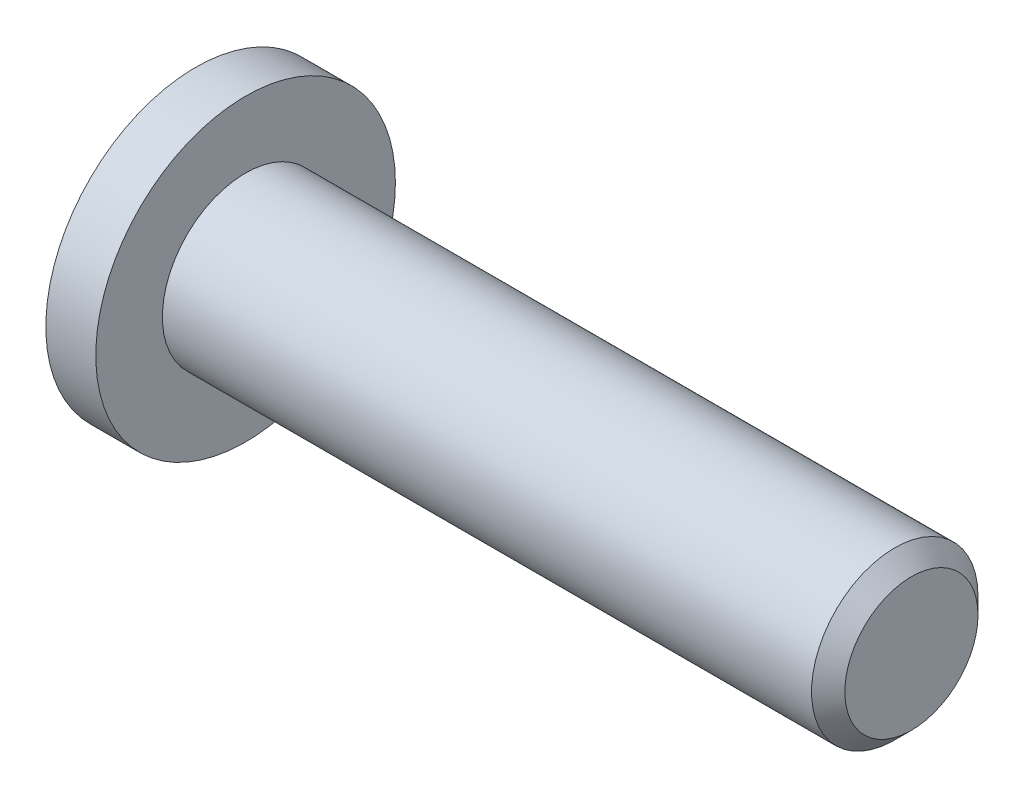
ISO-10303-21;
HEADER;
FILE_DESCRIPTION(('STEP AP214'),'2;1');
FILE_NAME('part.step','',(''),(''),'','','');
FILE_SCHEMA(('AUTOMOTIVE_DESIGN { 1 0 10303 214 1 1 1 1 }'));
ENDSEC;
DATA;
#1=APPLICATION_CONTEXT('core data for automotive mechanical design processes');
#2=APPLICATION_PROTOCOL_DEFINITION('international standard','automotive_design',2000,#1);
#3=PRODUCT_CONTEXT('',#1,'mechanical');
#4=PRODUCT('Part','Part','',(#3));
#5=PRODUCT_RELATED_PRODUCT_CATEGORY('part','',(#4));
#6=PRODUCT_DEFINITION_FORMATION('','',#4);
#7=PRODUCT_DEFINITION_CONTEXT('part definition',#1,'design');
#8=PRODUCT_DEFINITION('design','',#6,#7);
#9=PRODUCT_DEFINITION_SHAPE('','',#8);
#10=(LENGTH_UNIT() NAMED_UNIT(*) SI_UNIT(.MILLI.,.METRE.));
#11=(NAMED_UNIT(*) PLANE_ANGLE_UNIT() SI_UNIT($,.RADIAN.));
#12=(NAMED_UNIT(*) SI_UNIT($,.STERADIAN.) SOLID_ANGLE_UNIT());
#13=UNCERTAINTY_MEASURE_WITH_UNIT(LENGTH_MEASURE(1.E-05),#10,'distance_accuracy_value','');
#14=(GEOMETRIC_REPRESENTATION_CONTEXT(3) GLOBAL_UNCERTAINTY_ASSIGNED_CONTEXT((#13)) GLOBAL_UNIT_ASSIGNED_CONTEXT((#10,
#11,#12)) REPRESENTATION_CONTEXT('',''));
#15=CARTESIAN_POINT('',(0.,0.,0.));
#16=DIRECTION('',(0.,0.,1.));
#17=DIRECTION('',(1.,0.,0.));
#18=AXIS2_PLACEMENT_3D('',#15,#16,#17);
#19=CARTESIAN_POINT('',(1.5,0.,0.));
#20=DIRECTION('',(-1.,0.,0.));
#21=DIRECTION('',(0.,0.,1.));
#22=AXIS2_PLACEMENT_3D('',#19,#20,#21);
#23=CYLINDRICAL_SURFACE('',#22,4.5);
#24=CARTESIAN_POINT('',(1.5,0.,0.));
#25=DIRECTION('',(1.,0.,0.));
#26=DIRECTION('',(0.,0.,-1.));
#27=AXIS2_PLACEMENT_3D('',#24,#25,#26);
#28=CIRCLE('',#27,4.5);
#29=CARTESIAN_POINT('',(1.5,0.,-4.5));
#30=VERTEX_POINT('',#29);
#31=EDGE_CURVE('E149',#30,#30,#28,.T.);
#32=ORIENTED_EDGE('',*,*,#31,.F.);
#33=EDGE_LOOP('',(#32));
#34=FACE_BOUND('',#33,.T.);
#35=CARTESIAN_POINT('',(0.,0.,0.));
#36=DIRECTION('',(1.,0.,0.));
#37=DIRECTION('',(0.,0.,-1.));
#38=AXIS2_PLACEMENT_3D('',#35,#36,#37);
#39=CIRCLE('',#38,4.5);
#40=CARTESIAN_POINT('',(0.,0.,-4.5));
#41=VERTEX_POINT('',#40);
#42=EDGE_CURVE('E148',#41,#41,#39,.T.);
#43=ORIENTED_EDGE('',*,*,#42,.T.);
#44=EDGE_LOOP('',(#43));
#45=FACE_BOUND('',#44,.T.);
#46=ADVANCED_FACE('F38',(#34,#45),#23,.T.);
#47=CARTESIAN_POINT('',(1.5,0.,0.));
#48=DIRECTION('',(1.,0.,0.));
#49=DIRECTION('',(0.,0.,-1.));
#50=AXIS2_PLACEMENT_3D('',#47,#48,#49);
#51=PLANE('',#50);
#52=CARTESIAN_POINT('',(1.5,0.,0.));
#53=DIRECTION('',(1.,0.,0.));
#54=DIRECTION('',(0.,0.,-1.));
#55=AXIS2_PLACEMENT_3D('',#52,#53,#54);
#56=CIRCLE('',#55,2.5);
#57=CARTESIAN_POINT('',(1.5,0.,-2.5));
#58=VERTEX_POINT('',#57);
#59=EDGE_CURVE('E140',#58,#58,#56,.T.);
#60=ORIENTED_EDGE('',*,*,#59,.F.);
#61=EDGE_LOOP('',(#60));
#62=FACE_BOUND('',#61,.T.);
#63=ORIENTED_EDGE('',*,*,#31,.T.);
#64=EDGE_LOOP('',(#63));
#65=FACE_BOUND('',#64,.T.);
#66=ADVANCED_FACE('F167',(#62,#65),#51,.T.);
#67=CARTESIAN_POINT('',(0.,0.,0.));
#68=DIRECTION('',(1.,0.,0.));
#69=DIRECTION('',(0.,0.,-1.));
#70=AXIS2_PLACEMENT_3D('',#67,#68,#69);
#71=PLANE('',#70);
#72=DIRECTION('',(0.,-0.5,-0.866025403784439));
#73=VECTOR('',#72,1.);
#74=CARTESIAN_POINT('',(0.,1.7320508075689,0.));
#75=LINE('',#74,#73);
#76=CARTESIAN_POINT('',(0.,1.7320508075689,0.));
#77=VERTEX_POINT('',#76);
#78=CARTESIAN_POINT('',(0.,0.866025403784429,-1.50000000000002));
#79=VERTEX_POINT('',#78);
#80=EDGE_CURVE('E127',#77,#79,#75,.T.);
#81=ORIENTED_EDGE('',*,*,#80,.F.);
#82=DIRECTION('',(0.,0.499999999999998,-0.866025403784439));
#83=VECTOR('',#82,1.);
#84=CARTESIAN_POINT('',(0.,0.866025403784457,1.49999999999998));
#85=LINE('',#84,#83);
#86=CARTESIAN_POINT('',(0.,0.866025403784457,1.49999999999998));
#87=VERTEX_POINT('',#86);
#88=EDGE_CURVE('E53',#87,#77,#85,.T.);
#89=ORIENTED_EDGE('',*,*,#88,.F.);
#90=DIRECTION('',(0.,0.999999999999998,0.));
#91=VECTOR('',#90,1.);
#92=CARTESIAN_POINT('',(0.,-0.866025403784429,1.49999999999998));
#93=LINE('',#92,#91);
#94=CARTESIAN_POINT('',(0.,-0.866025403784429,1.49999999999998));
#95=VERTEX_POINT('',#94);
#96=EDGE_CURVE('E136',#95,#87,#93,.T.);
#97=ORIENTED_EDGE('',*,*,#96,.F.);
#98=DIRECTION('',(0.,0.5,0.866025403784439));
#99=VECTOR('',#98,1.);
#100=CARTESIAN_POINT('',(0.,-1.73205080756886,0.));
#101=LINE('',#100,#99);
#102=CARTESIAN_POINT('',(0.,-1.73205080756886,0.));
#103=VERTEX_POINT('',#102);
#104=EDGE_CURVE('E134',#103,#95,#101,.T.);
#105=ORIENTED_EDGE('',*,*,#104,.F.);
#106=DIRECTION('',(0.,-0.499999999999999,0.866025403784439));
#107=VECTOR('',#106,1.);
#108=CARTESIAN_POINT('',(0.,-0.866025403784415,-1.50000000000003));
#109=LINE('',#108,#107);
#110=CARTESIAN_POINT('',(0.,-0.866025403784415,-1.50000000000003));
#111=VERTEX_POINT('',#110);
#112=EDGE_CURVE('E101',#111,#103,#109,.T.);
#113=ORIENTED_EDGE('',*,*,#112,.F.);
#114=DIRECTION('',(0.,-0.999999999999998,0.));
#115=VECTOR('',#114,1.);
#116=CARTESIAN_POINT('',(0.,0.866025403784429,-1.50000000000002));
#117=LINE('',#116,#115);
#118=EDGE_CURVE('E130',#79,#111,#117,.T.);
#119=ORIENTED_EDGE('',*,*,#118,.F.);
#120=EDGE_LOOP('',(#81,#89,#97,#105,#113,#119));
#121=FACE_BOUND('',#120,.T.);
#122=ORIENTED_EDGE('',*,*,#42,.F.);
#123=EDGE_LOOP('',(#122));
#124=FACE_BOUND('',#123,.T.);
#125=ADVANCED_FACE('F172',(#121,#124),#71,.F.);
#126=CARTESIAN_POINT('',(21.5,0.,0.));
#127=DIRECTION('',(-1.,0.,0.));
#128=DIRECTION('',(0.,0.,1.));
#129=AXIS2_PLACEMENT_3D('',#126,#127,#128);
#130=CYLINDRICAL_SURFACE('',#129,2.5);
#131=CARTESIAN_POINT('',(21.,0.,0.));
#132=DIRECTION('',(1.,0.,0.));
#133=DIRECTION('',(0.,0.,-1.));
#134=AXIS2_PLACEMENT_3D('',#131,#132,#133);
#135=CIRCLE('',#134,2.5);
#136=CARTESIAN_POINT('',(21.,0.,-2.5));
#137=VERTEX_POINT('',#136);
#138=EDGE_CURVE('E11',#137,#137,#135,.F.);
#139=ORIENTED_EDGE('',*,*,#138,.T.);
#140=EDGE_LOOP('',(#139));
#141=FACE_BOUND('',#140,.T.);
#142=ORIENTED_EDGE('',*,*,#59,.T.);
#143=EDGE_LOOP('',(#142));
#144=FACE_BOUND('',#143,.T.);
#145=ADVANCED_FACE('F179',(#141,#144),#130,.T.);
#146=CARTESIAN_POINT('',(21.5,0.,0.));
#147=DIRECTION('',(1.,0.,0.));
#148=DIRECTION('',(0.,0.,-1.));
#149=AXIS2_PLACEMENT_3D('',#146,#147,#148);
#150=PLANE('',#149);
#151=CARTESIAN_POINT('',(21.5,0.,0.));
#152=DIRECTION('',(1.,0.,0.));
#153=DIRECTION('',(0.,0.,-1.));
#154=AXIS2_PLACEMENT_3D('',#151,#152,#153);
#155=CIRCLE('',#154,2.);
#156=CARTESIAN_POINT('',(21.5,0.,-2.));
#157=VERTEX_POINT('',#156);
#158=EDGE_CURVE('E46',#157,#157,#155,.T.);
#159=ORIENTED_EDGE('',*,*,#158,.T.);
#160=EDGE_LOOP('',(#159));
#161=FACE_BOUND('',#160,.T.);
#162=ADVANCED_FACE('F156',(#161),#150,.T.);
#163=CARTESIAN_POINT('',(3.,0.866025403784457,1.49999999999998));
#164=DIRECTION('',(0.,0.866025403784437,0.500000000000001));
#165=DIRECTION('',(0.,-0.499999999999998,0.866025403784439));
#166=AXIS2_PLACEMENT_3D('',#163,#164,#165);
#167=PLANE('',#166);
#168=ORIENTED_EDGE('',*,*,#88,.T.);
#169=DIRECTION('',(-1.,0.,0.));
#170=VECTOR('',#169,1.);
#171=CARTESIAN_POINT('',(3.,1.7320508075689,0.));
#172=LINE('',#171,#170);
#173=CARTESIAN_POINT('',(3.,1.7320508075689,0.));
#174=VERTEX_POINT('',#173);
#175=EDGE_CURVE('E83',#174,#77,#172,.T.);
#176=ORIENTED_EDGE('',*,*,#175,.F.);
#177=DIRECTION('',(0.,0.499999999999998,-0.866025403784439));
#178=VECTOR('',#177,1.);
#179=CARTESIAN_POINT('',(3.,0.866025403784457,1.49999999999998));
#180=LINE('',#179,#178);
#181=CARTESIAN_POINT('',(3.,0.866025403784457,1.49999999999998));
#182=VERTEX_POINT('',#181);
#183=EDGE_CURVE('E138',#182,#174,#180,.T.);
#184=ORIENTED_EDGE('',*,*,#183,.F.);
#185=DIRECTION('',(-1.,0.,0.));
#186=VECTOR('',#185,1.);
#187=CARTESIAN_POINT('',(3.,0.866025403784457,1.49999999999998));
#188=LINE('',#187,#186);
#189=EDGE_CURVE('E61',#182,#87,#188,.T.);
#190=ORIENTED_EDGE('',*,*,#189,.T.);
#191=EDGE_LOOP('',(#168,#176,#184,#190));
#192=FACE_BOUND('',#191,.T.);
#193=ADVANCED_FACE('F187',(#192),#167,.F.);
#194=CARTESIAN_POINT('',(3.,-0.866025403784429,1.49999999999998));
#195=DIRECTION('',(0.,0.,0.999999999999999));
#196=DIRECTION('',(0.,-0.999999999999998,0.));
#197=AXIS2_PLACEMENT_3D('',#194,#195,#196);
#198=PLANE('',#197);
#199=ORIENTED_EDGE('',*,*,#96,.T.);
#200=ORIENTED_EDGE('',*,*,#189,.F.);
#201=DIRECTION('',(0.,0.999999999999998,0.));
#202=VECTOR('',#201,1.);
#203=CARTESIAN_POINT('',(3.,-0.866025403784429,1.49999999999998));
#204=LINE('',#203,#202);
#205=CARTESIAN_POINT('',(3.,-0.866025403784429,1.49999999999998));
#206=VERTEX_POINT('',#205);
#207=EDGE_CURVE('E113',#206,#182,#204,.T.);
#208=ORIENTED_EDGE('',*,*,#207,.F.);
#209=DIRECTION('',(-1.,0.,0.));
#210=VECTOR('',#209,1.);
#211=CARTESIAN_POINT('',(3.,-0.866025403784429,1.49999999999998));
#212=LINE('',#211,#210);
#213=EDGE_CURVE('E105',#206,#95,#212,.T.);
#214=ORIENTED_EDGE('',*,*,#213,.T.);
#215=EDGE_LOOP('',(#199,#200,#208,#214));
#216=FACE_BOUND('',#215,.T.);
#217=ADVANCED_FACE('F190',(#216),#198,.F.);
#218=CARTESIAN_POINT('',(3.,-1.73205080756886,0.));
#219=DIRECTION('',(0.,-0.866025403784437,0.5));
#220=DIRECTION('',(0.,-0.5,-0.866025403784439));
#221=AXIS2_PLACEMENT_3D('',#218,#219,#220);
#222=PLANE('',#221);
#223=ORIENTED_EDGE('',*,*,#104,.T.);
#224=ORIENTED_EDGE('',*,*,#213,.F.);
#225=DIRECTION('',(0.,0.5,0.866025403784439));
#226=VECTOR('',#225,1.);
#227=CARTESIAN_POINT('',(3.,-1.73205080756886,0.));
#228=LINE('',#227,#226);
#229=CARTESIAN_POINT('',(3.,-1.73205080756886,0.));
#230=VERTEX_POINT('',#229);
#231=EDGE_CURVE('E109',#230,#206,#228,.T.);
#232=ORIENTED_EDGE('',*,*,#231,.F.);
#233=DIRECTION('',(-1.,0.,0.));
#234=VECTOR('',#233,1.);
#235=CARTESIAN_POINT('',(3.,-1.73205080756886,0.));
#236=LINE('',#235,#234);
#237=EDGE_CURVE('E94',#230,#103,#236,.T.);
#238=ORIENTED_EDGE('',*,*,#237,.T.);
#239=EDGE_LOOP('',(#223,#224,#232,#238));
#240=FACE_BOUND('',#239,.T.);
#241=ADVANCED_FACE('F110',(#240),#222,.F.);
#242=CARTESIAN_POINT('',(3.,-0.866025403784415,-1.50000000000003));
#243=DIRECTION('',(0.,-0.866025403784437,-0.500000000000001));
#244=DIRECTION('',(0.,0.499999999999998,-0.866025403784439));
#245=AXIS2_PLACEMENT_3D('',#242,#243,#244);
#246=PLANE('',#245);
#247=ORIENTED_EDGE('',*,*,#112,.T.);
#248=ORIENTED_EDGE('',*,*,#237,.F.);
#249=DIRECTION('',(0.,-0.499999999999999,0.866025403784439));
#250=VECTOR('',#249,1.);
#251=CARTESIAN_POINT('',(3.,-0.866025403784415,-1.50000000000003));
#252=LINE('',#251,#250);
#253=CARTESIAN_POINT('',(3.,-0.866025403784415,-1.50000000000003));
#254=VERTEX_POINT('',#253);
#255=EDGE_CURVE('E98',#254,#230,#252,.T.);
#256=ORIENTED_EDGE('',*,*,#255,.F.);
#257=DIRECTION('',(-1.,0.,0.));
#258=VECTOR('',#257,1.);
#259=CARTESIAN_POINT('',(3.,-0.866025403784415,-1.50000000000003));
#260=LINE('',#259,#258);
#261=EDGE_CURVE('E106',#254,#111,#260,.T.);
#262=ORIENTED_EDGE('',*,*,#261,.T.);
#263=EDGE_LOOP('',(#247,#248,#256,#262));
#264=FACE_BOUND('',#263,.T.);
#265=ADVANCED_FACE('F96',(#264),#246,.F.);
#266=CARTESIAN_POINT('',(3.,0.866025403784429,-1.50000000000002));
#267=DIRECTION('',(0.,0.,-1.));
#268=DIRECTION('',(-1.,0.,0.));
#269=AXIS2_PLACEMENT_3D('',#266,#267,#268);
#270=PLANE('',#269);
#271=ORIENTED_EDGE('',*,*,#118,.T.);
#272=ORIENTED_EDGE('',*,*,#261,.F.);
#273=DIRECTION('',(0.,-0.999999999999998,0.));
#274=VECTOR('',#273,1.);
#275=CARTESIAN_POINT('',(3.,0.866025403784429,-1.50000000000002));
#276=LINE('',#275,#274);
#277=CARTESIAN_POINT('',(3.,0.866025403784429,-1.50000000000002));
#278=VERTEX_POINT('',#277);
#279=EDGE_CURVE('E119',#278,#254,#276,.T.);
#280=ORIENTED_EDGE('',*,*,#279,.F.);
#281=DIRECTION('',(-1.,0.,0.));
#282=VECTOR('',#281,1.);
#283=CARTESIAN_POINT('',(3.,0.866025403784429,-1.50000000000002));
#284=LINE('',#283,#282);
#285=EDGE_CURVE('E143',#278,#79,#284,.T.);
#286=ORIENTED_EDGE('',*,*,#285,.T.);
#287=EDGE_LOOP('',(#271,#272,#280,#286));
#288=FACE_BOUND('',#287,.T.);
#289=ADVANCED_FACE('F193',(#288),#270,.F.);
#290=CARTESIAN_POINT('',(3.,1.7320508075689,0.));
#291=DIRECTION('',(0.,0.866025403784437,-0.5));
#292=DIRECTION('',(0.,0.5,0.866025403784439));
#293=AXIS2_PLACEMENT_3D('',#290,#291,#292);
#294=PLANE('',#293);
#295=ORIENTED_EDGE('',*,*,#80,.T.);
#296=ORIENTED_EDGE('',*,*,#285,.F.);
#297=DIRECTION('',(0.,-0.5,-0.866025403784439));
#298=VECTOR('',#297,1.);
#299=CARTESIAN_POINT('',(3.,1.7320508075689,0.));
#300=LINE('',#299,#298);
#301=EDGE_CURVE('E121',#174,#278,#300,.T.);
#302=ORIENTED_EDGE('',*,*,#301,.F.);
#303=ORIENTED_EDGE('',*,*,#175,.T.);
#304=EDGE_LOOP('',(#295,#296,#302,#303));
#305=FACE_BOUND('',#304,.T.);
#306=ADVANCED_FACE('F163',(#305),#294,.F.);
#307=CARTESIAN_POINT('',(3.,0.,0.));
#308=DIRECTION('',(-1.,0.,0.));
#309=DIRECTION('',(0.,0.,1.));
#310=AXIS2_PLACEMENT_3D('',#307,#308,#309);
#311=PLANE('',#310);
#312=ORIENTED_EDGE('',*,*,#183,.T.);
#313=ORIENTED_EDGE('',*,*,#301,.T.);
#314=ORIENTED_EDGE('',*,*,#279,.T.);
#315=ORIENTED_EDGE('',*,*,#255,.T.);
#316=ORIENTED_EDGE('',*,*,#231,.T.);
#317=ORIENTED_EDGE('',*,*,#207,.T.);
#318=EDGE_LOOP('',(#312,#313,#314,#315,#316,#317));
#319=FACE_BOUND('',#318,.T.);
#320=ADVANCED_FACE('F116',(#319),#311,.T.);
#321=CARTESIAN_POINT('',(21.5,0.,0.));
#322=DIRECTION('',(-1.,0.,0.));
#323=DIRECTION('',(0.,0.,1.));
#324=AXIS2_PLACEMENT_3D('',#321,#322,#323);
#325=CONICAL_SURFACE('',#324,2.,0.785398163397446);
#326=ORIENTED_EDGE('',*,*,#138,.F.);
#327=EDGE_LOOP('',(#326));
#328=FACE_BOUND('',#327,.T.);
#329=ORIENTED_EDGE('',*,*,#158,.F.);
#330=EDGE_LOOP('',(#329));
#331=FACE_BOUND('',#330,.T.);
#332=ADVANCED_FACE('F40',(#328,#331),#325,.T.);
#333=CLOSED_SHELL('',(#46,#66,#125,#145,#162,#193,#217,#241,#265,#289,#306,#320,#332));
#334=MANIFOLD_SOLID_BREP('B2',#333);
#335=ADVANCED_BREP_SHAPE_REPRESENTATION('',(#18,#334),#14);
#336=SHAPE_DEFINITION_REPRESENTATION(#9,#335);
ENDSEC;
END-ISO-10303-21;
